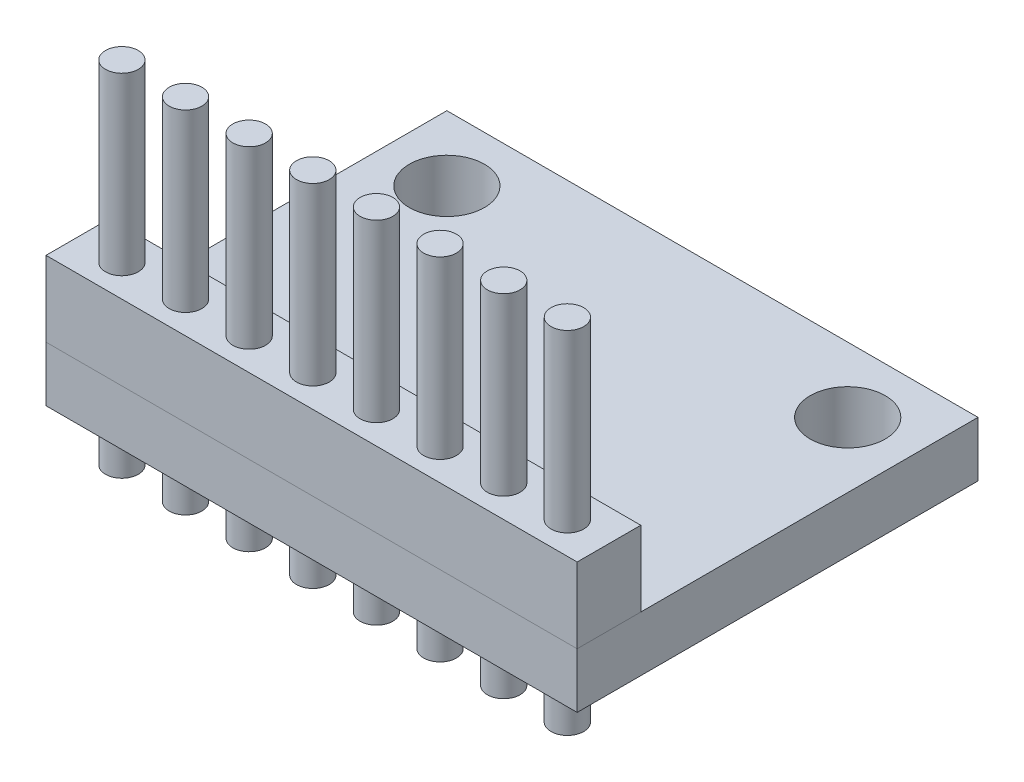
ISO-10303-21;
HEADER;
FILE_DESCRIPTION(('STEP AP214'),'2;1');
FILE_NAME('part.step','',(''),(''),'','','');
FILE_SCHEMA(('AUTOMOTIVE_DESIGN { 1 0 10303 214 1 1 1 1 }'));
ENDSEC;
DATA;
#1=APPLICATION_CONTEXT('core data for automotive mechanical design processes');
#2=APPLICATION_PROTOCOL_DEFINITION('international standard','automotive_design',2000,#1);
#3=PRODUCT_CONTEXT('',#1,'mechanical');
#4=PRODUCT('Part','Part','',(#3));
#5=PRODUCT_RELATED_PRODUCT_CATEGORY('part','',(#4));
#6=PRODUCT_DEFINITION_FORMATION('','',#4);
#7=PRODUCT_DEFINITION_CONTEXT('part definition',#1,'design');
#8=PRODUCT_DEFINITION('design','',#6,#7);
#9=PRODUCT_DEFINITION_SHAPE('','',#8);
#10=(LENGTH_UNIT() NAMED_UNIT(*) SI_UNIT(.MILLI.,.METRE.));
#11=(NAMED_UNIT(*) PLANE_ANGLE_UNIT() SI_UNIT($,.RADIAN.));
#12=(NAMED_UNIT(*) SI_UNIT($,.STERADIAN.) SOLID_ANGLE_UNIT());
#13=UNCERTAINTY_MEASURE_WITH_UNIT(LENGTH_MEASURE(1.E-05),#10,'distance_accuracy_value','');
#14=(GEOMETRIC_REPRESENTATION_CONTEXT(3) GLOBAL_UNCERTAINTY_ASSIGNED_CONTEXT((#13)) GLOBAL_UNIT_ASSIGNED_CONTEXT((#10,
#11,#12)) REPRESENTATION_CONTEXT('',''));
#15=CARTESIAN_POINT('',(0.,0.,0.));
#16=DIRECTION('',(0.,0.,1.));
#17=DIRECTION('',(1.,0.,0.));
#18=AXIS2_PLACEMENT_3D('',#15,#16,#17);
#19=CARTESIAN_POINT('',(-8.66705882352942,5.2,9.45294117647059));
#20=DIRECTION('',(1.,0.,0.));
#21=DIRECTION('',(0.,0.,-1.));
#22=AXIS2_PLACEMENT_3D('',#19,#20,#21);
#23=PLANE('',#22);
#24=DIRECTION('',(0.,0.,1.));
#25=VECTOR('',#24,1.);
#26=CARTESIAN_POINT('',(-8.66705882352942,2.2,9.45294117647059));
#27=LINE('',#26,#25);
#28=CARTESIAN_POINT('',(-8.66705882352942,2.2,6.91294117647059));
#29=VERTEX_POINT('',#28);
#30=CARTESIAN_POINT('',(-8.66705882352942,2.2,9.45294117647059));
#31=VERTEX_POINT('',#30);
#32=EDGE_CURVE('E105',#29,#31,#27,.T.);
#33=ORIENTED_EDGE('',*,*,#32,.T.);
#34=DIRECTION('',(0.,-1.,0.));
#35=VECTOR('',#34,1.);
#36=CARTESIAN_POINT('',(-8.66705882352942,5.2,9.45294117647059));
#37=LINE('',#36,#35);
#38=CARTESIAN_POINT('',(-8.66705882352942,5.2,9.45294117647059));
#39=VERTEX_POINT('',#38);
#40=EDGE_CURVE('E12',#39,#31,#37,.T.);
#41=ORIENTED_EDGE('',*,*,#40,.F.);
#42=DIRECTION('',(0.,0.,1.));
#43=VECTOR('',#42,1.);
#44=CARTESIAN_POINT('',(-8.66705882352942,5.2,9.45294117647059));
#45=LINE('',#44,#43);
#46=CARTESIAN_POINT('',(-8.66705882352942,5.2,6.91294117647059));
#47=VERTEX_POINT('',#46);
#48=EDGE_CURVE('E93',#47,#39,#45,.T.);
#49=ORIENTED_EDGE('',*,*,#48,.F.);
#50=DIRECTION('',(0.,-1.,0.));
#51=VECTOR('',#50,1.);
#52=CARTESIAN_POINT('',(-8.66705882352942,5.2,6.91294117647059));
#53=LINE('',#52,#51);
#54=EDGE_CURVE('E101',#47,#29,#53,.T.);
#55=ORIENTED_EDGE('',*,*,#54,.T.);
#56=EDGE_LOOP('',(#33,#41,#49,#55));
#57=FACE_BOUND('',#56,.T.);
#58=ADVANCED_FACE('F42',(#57),#23,.F.);
#59=CARTESIAN_POINT('',(-8.66705882352942,5.2,9.45294117647059));
#60=DIRECTION('',(0.,0.,-1.));
#61=DIRECTION('',(-1.,0.,0.));
#62=AXIS2_PLACEMENT_3D('',#59,#60,#61);
#63=PLANE('',#62);
#64=DIRECTION('',(1.,0.,0.));
#65=VECTOR('',#64,1.);
#66=CARTESIAN_POINT('',(-8.66705882352942,2.2,9.45294117647059));
#67=LINE('',#66,#65);
#68=CARTESIAN_POINT('',(12.5329411764706,2.2,9.45294117647059));
#69=VERTEX_POINT('',#68);
#70=EDGE_CURVE('E97',#31,#69,#67,.T.);
#71=ORIENTED_EDGE('',*,*,#70,.T.);
#72=DIRECTION('',(0.,-1.,0.));
#73=VECTOR('',#72,1.);
#74=CARTESIAN_POINT('',(12.5329411764706,5.2,9.45294117647059));
#75=LINE('',#74,#73);
#76=CARTESIAN_POINT('',(12.5329411764706,5.2,9.45294117647059));
#77=VERTEX_POINT('',#76);
#78=EDGE_CURVE('E50',#77,#69,#75,.T.);
#79=ORIENTED_EDGE('',*,*,#78,.F.);
#80=DIRECTION('',(1.,0.,0.));
#81=VECTOR('',#80,1.);
#82=CARTESIAN_POINT('',(-8.66705882352942,5.2,9.45294117647059));
#83=LINE('',#82,#81);
#84=EDGE_CURVE('E88',#39,#77,#83,.T.);
#85=ORIENTED_EDGE('',*,*,#84,.F.);
#86=ORIENTED_EDGE('',*,*,#40,.T.);
#87=EDGE_LOOP('',(#71,#79,#85,#86));
#88=FACE_BOUND('',#87,.T.);
#89=ADVANCED_FACE('F96',(#88),#63,.F.);
#90=CARTESIAN_POINT('',(12.5329411764706,5.2,9.45294117647059));
#91=DIRECTION('',(-1.,0.,0.));
#92=DIRECTION('',(0.,0.,1.));
#93=AXIS2_PLACEMENT_3D('',#90,#91,#92);
#94=PLANE('',#93);
#95=DIRECTION('',(0.,0.,-1.));
#96=VECTOR('',#95,1.);
#97=CARTESIAN_POINT('',(12.5329411764706,2.2,9.45294117647059));
#98=LINE('',#97,#96);
#99=CARTESIAN_POINT('',(12.5329411764706,2.2,6.91294117647059));
#100=VERTEX_POINT('',#99);
#101=EDGE_CURVE('E75',#69,#100,#98,.T.);
#102=ORIENTED_EDGE('',*,*,#101,.T.);
#103=DIRECTION('',(0.,-1.,0.));
#104=VECTOR('',#103,1.);
#105=CARTESIAN_POINT('',(12.5329411764706,5.2,6.91294117647059));
#106=LINE('',#105,#104);
#107=CARTESIAN_POINT('',(12.5329411764706,5.2,6.91294117647059));
#108=VERTEX_POINT('',#107);
#109=EDGE_CURVE('E98',#108,#100,#106,.T.);
#110=ORIENTED_EDGE('',*,*,#109,.F.);
#111=DIRECTION('',(0.,0.,-1.));
#112=VECTOR('',#111,1.);
#113=CARTESIAN_POINT('',(12.5329411764706,5.2,9.45294117647059));
#114=LINE('',#113,#112);
#115=EDGE_CURVE('E91',#77,#108,#114,.T.);
#116=ORIENTED_EDGE('',*,*,#115,.F.);
#117=ORIENTED_EDGE('',*,*,#78,.T.);
#118=EDGE_LOOP('',(#102,#110,#116,#117));
#119=FACE_BOUND('',#118,.T.);
#120=ADVANCED_FACE('F99',(#119),#94,.F.);
#121=CARTESIAN_POINT('',(-8.66705882352942,5.2,6.91294117647059));
#122=DIRECTION('',(0.,0.,1.));
#123=DIRECTION('',(1.,0.,0.));
#124=AXIS2_PLACEMENT_3D('',#121,#122,#123);
#125=PLANE('',#124);
#126=DIRECTION('',(-1.,0.,0.));
#127=VECTOR('',#126,1.);
#128=CARTESIAN_POINT('',(-8.66705882352942,2.2,6.91294117647059));
#129=LINE('',#128,#127);
#130=EDGE_CURVE('E81',#100,#29,#129,.T.);
#131=ORIENTED_EDGE('',*,*,#130,.T.);
#132=ORIENTED_EDGE('',*,*,#54,.F.);
#133=DIRECTION('',(-1.,0.,0.));
#134=VECTOR('',#133,1.);
#135=CARTESIAN_POINT('',(-8.66705882352942,5.2,6.91294117647059));
#136=LINE('',#135,#134);
#137=EDGE_CURVE('E58',#108,#47,#136,.T.);
#138=ORIENTED_EDGE('',*,*,#137,.F.);
#139=ORIENTED_EDGE('',*,*,#109,.T.);
#140=EDGE_LOOP('',(#131,#132,#138,#139));
#141=FACE_BOUND('',#140,.T.);
#142=ADVANCED_FACE('F112',(#141),#125,.F.);
#143=CARTESIAN_POINT('',(0.,5.2,0.));
#144=DIRECTION('',(0.,-1.,0.));
#145=DIRECTION('',(0.,0.,-1.));
#146=AXIS2_PLACEMENT_3D('',#143,#144,#145);
#147=PLANE('',#146);
#148=ORIENTED_EDGE('',*,*,#48,.T.);
#149=ORIENTED_EDGE('',*,*,#84,.T.);
#150=ORIENTED_EDGE('',*,*,#115,.T.);
#151=ORIENTED_EDGE('',*,*,#137,.T.);
#152=EDGE_LOOP('',(#148,#149,#150,#151));
#153=FACE_BOUND('',#152,.T.);
#154=ADVANCED_FACE('F89',(#153),#147,.F.);
#155=CARTESIAN_POINT('',(0.,2.2,0.));
#156=DIRECTION('',(0.,-1.,0.));
#157=DIRECTION('',(0.,0.,-1.));
#158=AXIS2_PLACEMENT_3D('',#155,#156,#157);
#159=PLANE('',#158);
#160=ORIENTED_EDGE('',*,*,#32,.F.);
#161=ORIENTED_EDGE('',*,*,#130,.F.);
#162=ORIENTED_EDGE('',*,*,#101,.F.);
#163=ORIENTED_EDGE('',*,*,#70,.F.);
#164=EDGE_LOOP('',(#160,#161,#162,#163));
#165=FACE_BOUND('',#164,.T.);
#166=ADVANCED_FACE('F115',(#165),#159,.T.);
#167=CLOSED_SHELL('',(#58,#89,#120,#142,#154,#166));
#168=MANIFOLD_SOLID_BREP('B2',#167);
#169=CARTESIAN_POINT('',(0.,0.,0.));
#170=DIRECTION('',(0.,1.,0.));
#171=DIRECTION('',(0.,0.,1.));
#172=AXIS2_PLACEMENT_3D('',#169,#170,#171);
#173=PLANE('',#172);
#174=DIRECTION('',(0.,0.,1.));
#175=VECTOR('',#174,1.);
#176=CARTESIAN_POINT('',(-8.66705882352942,0.,-6.54705882352941));
#177=LINE('',#176,#175);
#178=CARTESIAN_POINT('',(-8.66705882352942,0.,-6.54705882352941));
#179=VERTEX_POINT('',#178);
#180=CARTESIAN_POINT('',(-8.66705882352942,0.,9.45294117647059));
#181=VERTEX_POINT('',#180);
#182=EDGE_CURVE('E338',#179,#181,#177,.T.);
#183=ORIENTED_EDGE('',*,*,#182,.F.);
#184=DIRECTION('',(-1.,0.,0.));
#185=VECTOR('',#184,1.);
#186=CARTESIAN_POINT('',(-8.66705882352942,0.,-6.54705882352941));
#187=LINE('',#186,#185);
#188=CARTESIAN_POINT('',(12.5329411764706,0.,-6.54705882352941));
#189=VERTEX_POINT('',#188);
#190=EDGE_CURVE('E345',#189,#179,#187,.T.);
#191=ORIENTED_EDGE('',*,*,#190,.F.);
#192=DIRECTION('',(0.,0.,-1.));
#193=VECTOR('',#192,1.);
#194=CARTESIAN_POINT('',(12.5329411764706,0.,-6.54705882352941));
#195=LINE('',#194,#193);
#196=CARTESIAN_POINT('',(12.5329411764706,0.,9.45294117647059));
#197=VERTEX_POINT('',#196);
#198=EDGE_CURVE('E356',#197,#189,#195,.T.);
#199=ORIENTED_EDGE('',*,*,#198,.F.);
#200=DIRECTION('',(1.,0.,0.));
#201=VECTOR('',#200,1.);
#202=CARTESIAN_POINT('',(-8.66705882352942,0.,9.45294117647059));
#203=LINE('',#202,#201);
#204=EDGE_CURVE('E354',#181,#197,#203,.T.);
#205=ORIENTED_EDGE('',*,*,#204,.F.);
#206=EDGE_LOOP('',(#183,#191,#199,#205));
#207=FACE_BOUND('',#206,.T.);
#208=CARTESIAN_POINT('',(-6.06705882352942,0.,-3.94705882352941));
#209=DIRECTION('',(0.,1.,0.));
#210=DIRECTION('',(0.,0.,1.));
#211=AXIS2_PLACEMENT_3D('',#208,#209,#210);
#212=CIRCLE('',#211,1.5);
#213=CARTESIAN_POINT('',(-6.06705882352942,0.,-2.44705882352941));
#214=VERTEX_POINT('',#213);
#215=EDGE_CURVE('E335',#214,#214,#212,.T.);
#216=ORIENTED_EDGE('',*,*,#215,.T.);
#217=EDGE_LOOP('',(#216));
#218=FACE_BOUND('',#217,.T.);
#219=CARTESIAN_POINT('',(9.93294117647058,0.,-3.94705882352941));
#220=DIRECTION('',(0.,1.,0.));
#221=DIRECTION('',(0.,0.,1.));
#222=AXIS2_PLACEMENT_3D('',#219,#220,#221);
#223=CIRCLE('',#222,1.5);
#224=CARTESIAN_POINT('',(9.93294117647058,0.,-2.44705882352941));
#225=VERTEX_POINT('',#224);
#226=EDGE_CURVE('E329',#225,#225,#223,.T.);
#227=ORIENTED_EDGE('',*,*,#226,.T.);
#228=EDGE_LOOP('',(#227));
#229=FACE_BOUND('',#228,.T.);
#230=CARTESIAN_POINT('',(-6.90705882352942,0.,8.18294117647059));
#231=DIRECTION('',(0.,1.,0.));
#232=DIRECTION('',(0.,0.,1.));
#233=AXIS2_PLACEMENT_3D('',#230,#231,#232);
#234=CIRCLE('',#233,0.653464602854397);
#235=CARTESIAN_POINT('',(-6.90705882352942,0.,8.83640577932498));
#236=VERTEX_POINT('',#235);
#237=EDGE_CURVE('E370',#236,#236,#234,.F.);
#238=ORIENTED_EDGE('',*,*,#237,.F.);
#239=EDGE_LOOP('',(#238));
#240=FACE_BOUND('',#239,.T.);
#241=CARTESIAN_POINT('',(-4.36705882352942,0.,8.18294117647059));
#242=DIRECTION('',(0.,1.,0.));
#243=DIRECTION('',(0.,0.,1.));
#244=AXIS2_PLACEMENT_3D('',#241,#242,#243);
#245=CIRCLE('',#244,0.653464602854397);
#246=CARTESIAN_POINT('',(-4.36705882352942,0.,8.83640577932498));
#247=VERTEX_POINT('',#246);
#248=EDGE_CURVE('E373',#247,#247,#245,.F.);
#249=ORIENTED_EDGE('',*,*,#248,.F.);
#250=EDGE_LOOP('',(#249));
#251=FACE_BOUND('',#250,.T.);
#252=CARTESIAN_POINT('',(-1.82705882352942,0.,8.18294117647059));
#253=DIRECTION('',(0.,1.,0.));
#254=DIRECTION('',(0.,0.,1.));
#255=AXIS2_PLACEMENT_3D('',#252,#253,#254);
#256=CIRCLE('',#255,0.653464602854398);
#257=CARTESIAN_POINT('',(-1.82705882352942,0.,8.83640577932498));
#258=VERTEX_POINT('',#257);
#259=EDGE_CURVE('E376',#258,#258,#256,.F.);
#260=ORIENTED_EDGE('',*,*,#259,.F.);
#261=EDGE_LOOP('',(#260));
#262=FACE_BOUND('',#261,.T.);
#263=CARTESIAN_POINT('',(0.712941176470581,0.,8.18294117647059));
#264=DIRECTION('',(0.,1.,0.));
#265=DIRECTION('',(0.,0.,1.));
#266=AXIS2_PLACEMENT_3D('',#263,#264,#265);
#267=CIRCLE('',#266,0.653464602854398);
#268=CARTESIAN_POINT('',(0.712941176470581,0.,8.83640577932498));
#269=VERTEX_POINT('',#268);
#270=EDGE_CURVE('E379',#269,#269,#267,.F.);
#271=ORIENTED_EDGE('',*,*,#270,.F.);
#272=EDGE_LOOP('',(#271));
#273=FACE_BOUND('',#272,.T.);
#274=CARTESIAN_POINT('',(3.25294117647058,0.,8.18294117647059));
#275=DIRECTION('',(0.,1.,0.));
#276=DIRECTION('',(0.,0.,1.));
#277=AXIS2_PLACEMENT_3D('',#274,#275,#276);
#278=CIRCLE('',#277,0.653464602854398);
#279=CARTESIAN_POINT('',(3.25294117647058,0.,8.83640577932498));
#280=VERTEX_POINT('',#279);
#281=EDGE_CURVE('E382',#280,#280,#278,.F.);
#282=ORIENTED_EDGE('',*,*,#281,.F.);
#283=EDGE_LOOP('',(#282));
#284=FACE_BOUND('',#283,.T.);
#285=CARTESIAN_POINT('',(5.79294117647058,0.,8.18294117647059));
#286=DIRECTION('',(0.,1.,0.));
#287=DIRECTION('',(0.,0.,1.));
#288=AXIS2_PLACEMENT_3D('',#285,#286,#287);
#289=CIRCLE('',#288,0.653464602854403);
#290=CARTESIAN_POINT('',(5.79294117647058,0.,8.83640577932499));
#291=VERTEX_POINT('',#290);
#292=EDGE_CURVE('E385',#291,#291,#289,.F.);
#293=ORIENTED_EDGE('',*,*,#292,.F.);
#294=EDGE_LOOP('',(#293));
#295=FACE_BOUND('',#294,.T.);
#296=CARTESIAN_POINT('',(8.33294117647058,0.,8.18294117647059));
#297=DIRECTION('',(0.,1.,0.));
#298=DIRECTION('',(0.,0.,1.));
#299=AXIS2_PLACEMENT_3D('',#296,#297,#298);
#300=CIRCLE('',#299,0.653464602854399);
#301=CARTESIAN_POINT('',(8.33294117647058,0.,8.83640577932499));
#302=VERTEX_POINT('',#301);
#303=EDGE_CURVE('E173',#302,#302,#300,.F.);
#304=ORIENTED_EDGE('',*,*,#303,.F.);
#305=EDGE_LOOP('',(#304));
#306=FACE_BOUND('',#305,.T.);
#307=CARTESIAN_POINT('',(10.8729411764706,0.,8.18294117647059));
#308=DIRECTION('',(0.,1.,0.));
#309=DIRECTION('',(0.,0.,1.));
#310=AXIS2_PLACEMENT_3D('',#307,#308,#309);
#311=CIRCLE('',#310,0.653464602854399);
#312=CARTESIAN_POINT('',(10.8729411764706,0.,8.83640577932499));
#313=VERTEX_POINT('',#312);
#314=EDGE_CURVE('E40',#313,#313,#311,.F.);
#315=ORIENTED_EDGE('',*,*,#314,.F.);
#316=EDGE_LOOP('',(#315));
#317=FACE_BOUND('',#316,.T.);
#318=DIRECTION('',(0.,0.,1.));
#319=VECTOR('',#318,1.);
#320=CARTESIAN_POINT('',(3.67491142262111,0.,-0.351705240859701));
#321=LINE('',#320,#319);
#322=CARTESIAN_POINT('',(3.67491142262111,0.,-0.351705240859701));
#323=VERTEX_POINT('',#322);
#324=CARTESIAN_POINT('',(3.67491142262111,0.,3.66190750557394));
#325=VERTEX_POINT('',#324);
#326=EDGE_CURVE('E250',#323,#325,#321,.T.);
#327=ORIENTED_EDGE('',*,*,#326,.F.);
#328=DIRECTION('',(1.,0.,0.));
#329=VECTOR('',#328,1.);
#330=CARTESIAN_POINT('',(3.67491142262111,0.,-0.351705240859701));
#331=LINE('',#330,#329);
#332=CARTESIAN_POINT('',(-1.17882744650899,0.,-0.351705240859701));
#333=VERTEX_POINT('',#332);
#334=EDGE_CURVE('E247',#333,#323,#331,.T.);
#335=ORIENTED_EDGE('',*,*,#334,.F.);
#336=DIRECTION('',(0.,0.,-1.));
#337=VECTOR('',#336,1.);
#338=CARTESIAN_POINT('',(-1.17882744650899,0.,-0.351705240859701));
#339=LINE('',#338,#337);
#340=CARTESIAN_POINT('',(-1.17882744650899,0.,3.66190750557394));
#341=VERTEX_POINT('',#340);
#342=EDGE_CURVE('E185',#341,#333,#339,.T.);
#343=ORIENTED_EDGE('',*,*,#342,.F.);
#344=DIRECTION('',(-1.,0.,0.));
#345=VECTOR('',#344,1.);
#346=CARTESIAN_POINT('',(3.67491142262111,0.,3.66190750557394));
#347=LINE('',#346,#345);
#348=EDGE_CURVE('E180',#325,#341,#347,.T.);
#349=ORIENTED_EDGE('',*,*,#348,.F.);
#350=EDGE_LOOP('',(#327,#335,#343,#349));
#351=FACE_BOUND('',#350,.T.);
#352=ADVANCED_FACE('F165',(#207,#218,#229,#240,#251,#262,#273,#284,#295,#306,#317,#351),#173,.F.);
#353=CARTESIAN_POINT('',(-8.66705882352942,2.2,-6.54705882352941));
#354=DIRECTION('',(1.,0.,0.));
#355=DIRECTION('',(0.,0.,-1.));
#356=AXIS2_PLACEMENT_3D('',#353,#354,#355);
#357=PLANE('',#356);
#358=ORIENTED_EDGE('',*,*,#182,.T.);
#359=DIRECTION('',(0.,-1.,0.));
#360=VECTOR('',#359,1.);
#361=CARTESIAN_POINT('',(-8.66705882352942,2.2,9.45294117647059));
#362=LINE('',#361,#360);
#363=CARTESIAN_POINT('',(-8.66705882352942,2.2,9.45294117647059));
#364=VERTEX_POINT('',#363);
#365=EDGE_CURVE('E367',#364,#181,#362,.T.);
#366=ORIENTED_EDGE('',*,*,#365,.F.);
#367=DIRECTION('',(0.,0.,1.));
#368=VECTOR('',#367,1.);
#369=CARTESIAN_POINT('',(-8.66705882352942,2.2,-6.54705882352941));
#370=LINE('',#369,#368);
#371=CARTESIAN_POINT('',(-8.66705882352942,2.2,-6.54705882352941));
#372=VERTEX_POINT('',#371);
#373=EDGE_CURVE('E341',#372,#364,#370,.T.);
#374=ORIENTED_EDGE('',*,*,#373,.F.);
#375=DIRECTION('',(0.,-1.,0.));
#376=VECTOR('',#375,1.);
#377=CARTESIAN_POINT('',(-8.66705882352942,2.2,-6.54705882352941));
#378=LINE('',#377,#376);
#379=EDGE_CURVE('E351',#372,#179,#378,.T.);
#380=ORIENTED_EDGE('',*,*,#379,.T.);
#381=EDGE_LOOP('',(#358,#366,#374,#380));
#382=FACE_BOUND('',#381,.T.);
#383=ADVANCED_FACE('F167',(#382),#357,.F.);
#384=CARTESIAN_POINT('',(-8.66705882352942,2.2,9.45294117647059));
#385=DIRECTION('',(0.,0.,-1.));
#386=DIRECTION('',(-1.,0.,0.));
#387=AXIS2_PLACEMENT_3D('',#384,#385,#386);
#388=PLANE('',#387);
#389=ORIENTED_EDGE('',*,*,#204,.T.);
#390=DIRECTION('',(0.,-1.,0.));
#391=VECTOR('',#390,1.);
#392=CARTESIAN_POINT('',(12.5329411764706,2.2,9.45294117647059));
#393=LINE('',#392,#391);
#394=CARTESIAN_POINT('',(12.5329411764706,2.2,9.45294117647059));
#395=VERTEX_POINT('',#394);
#396=EDGE_CURVE('E364',#395,#197,#393,.T.);
#397=ORIENTED_EDGE('',*,*,#396,.F.);
#398=DIRECTION('',(1.,0.,0.));
#399=VECTOR('',#398,1.);
#400=CARTESIAN_POINT('',(-8.66705882352942,2.2,9.45294117647059));
#401=LINE('',#400,#399);
#402=EDGE_CURVE('E344',#364,#395,#401,.T.);
#403=ORIENTED_EDGE('',*,*,#402,.F.);
#404=ORIENTED_EDGE('',*,*,#365,.T.);
#405=EDGE_LOOP('',(#389,#397,#403,#404));
#406=FACE_BOUND('',#405,.T.);
#407=ADVANCED_FACE('F545',(#406),#388,.F.);
#408=CARTESIAN_POINT('',(12.5329411764706,2.2,-6.54705882352941));
#409=DIRECTION('',(-1.,0.,0.));
#410=DIRECTION('',(0.,0.,1.));
#411=AXIS2_PLACEMENT_3D('',#408,#409,#410);
#412=PLANE('',#411);
#413=ORIENTED_EDGE('',*,*,#198,.T.);
#414=DIRECTION('',(0.,-1.,0.));
#415=VECTOR('',#414,1.);
#416=CARTESIAN_POINT('',(12.5329411764706,2.2,-6.54705882352941));
#417=LINE('',#416,#415);
#418=CARTESIAN_POINT('',(12.5329411764706,2.2,-6.54705882352941));
#419=VERTEX_POINT('',#418);
#420=EDGE_CURVE('E361',#419,#189,#417,.T.);
#421=ORIENTED_EDGE('',*,*,#420,.F.);
#422=DIRECTION('',(0.,0.,-1.));
#423=VECTOR('',#422,1.);
#424=CARTESIAN_POINT('',(12.5329411764706,2.2,-6.54705882352941));
#425=LINE('',#424,#423);
#426=EDGE_CURVE('E347',#395,#419,#425,.T.);
#427=ORIENTED_EDGE('',*,*,#426,.F.);
#428=ORIENTED_EDGE('',*,*,#396,.T.);
#429=EDGE_LOOP('',(#413,#421,#427,#428));
#430=FACE_BOUND('',#429,.T.);
#431=ADVANCED_FACE('F542',(#430),#412,.F.);
#432=CARTESIAN_POINT('',(-8.66705882352942,2.2,-6.54705882352941));
#433=DIRECTION('',(0.,0.,1.));
#434=DIRECTION('',(1.,0.,0.));
#435=AXIS2_PLACEMENT_3D('',#432,#433,#434);
#436=PLANE('',#435);
#437=ORIENTED_EDGE('',*,*,#190,.T.);
#438=ORIENTED_EDGE('',*,*,#379,.F.);
#439=DIRECTION('',(-1.,0.,0.));
#440=VECTOR('',#439,1.);
#441=CARTESIAN_POINT('',(-8.66705882352942,2.2,-6.54705882352941));
#442=LINE('',#441,#440);
#443=EDGE_CURVE('E349',#419,#372,#442,.T.);
#444=ORIENTED_EDGE('',*,*,#443,.F.);
#445=ORIENTED_EDGE('',*,*,#420,.T.);
#446=EDGE_LOOP('',(#437,#438,#444,#445));
#447=FACE_BOUND('',#446,.T.);
#448=ADVANCED_FACE('F537',(#447),#436,.F.);
#449=CARTESIAN_POINT('',(0.,2.2,0.));
#450=DIRECTION('',(0.,1.,0.));
#451=DIRECTION('',(0.,0.,1.));
#452=AXIS2_PLACEMENT_3D('',#449,#450,#451);
#453=PLANE('',#452);
#454=CARTESIAN_POINT('',(10.8729411764706,2.2,8.18294117647059));
#455=DIRECTION('',(0.,1.,0.));
#456=DIRECTION('',(0.,0.,1.));
#457=AXIS2_PLACEMENT_3D('',#454,#455,#456);
#458=CIRCLE('',#457,0.653464602854399);
#459=CARTESIAN_POINT('',(10.8729411764706,2.2,8.83640577932499));
#460=VERTEX_POINT('',#459);
#461=EDGE_CURVE('E262',#460,#460,#458,.F.);
#462=ORIENTED_EDGE('',*,*,#461,.T.);
#463=EDGE_LOOP('',(#462));
#464=FACE_BOUND('',#463,.T.);
#465=CARTESIAN_POINT('',(8.33294117647058,2.2,8.18294117647059));
#466=DIRECTION('',(0.,1.,0.));
#467=DIRECTION('',(0.,0.,1.));
#468=AXIS2_PLACEMENT_3D('',#465,#466,#467);
#469=CIRCLE('',#468,0.653464602854399);
#470=CARTESIAN_POINT('',(8.33294117647058,2.2,8.83640577932499));
#471=VERTEX_POINT('',#470);
#472=EDGE_CURVE('E271',#471,#471,#469,.F.);
#473=ORIENTED_EDGE('',*,*,#472,.T.);
#474=EDGE_LOOP('',(#473));
#475=FACE_BOUND('',#474,.T.);
#476=CARTESIAN_POINT('',(5.79294117647058,2.2,8.18294117647059));
#477=DIRECTION('',(0.,1.,0.));
#478=DIRECTION('',(0.,0.,1.));
#479=AXIS2_PLACEMENT_3D('',#476,#477,#478);
#480=CIRCLE('',#479,0.653464602854403);
#481=CARTESIAN_POINT('',(5.79294117647058,2.2,8.83640577932499));
#482=VERTEX_POINT('',#481);
#483=EDGE_CURVE('E280',#482,#482,#480,.F.);
#484=ORIENTED_EDGE('',*,*,#483,.T.);
#485=EDGE_LOOP('',(#484));
#486=FACE_BOUND('',#485,.T.);
#487=CARTESIAN_POINT('',(3.25294117647058,2.2,8.18294117647059));
#488=DIRECTION('',(0.,1.,0.));
#489=DIRECTION('',(0.,0.,1.));
#490=AXIS2_PLACEMENT_3D('',#487,#488,#489);
#491=CIRCLE('',#490,0.653464602854398);
#492=CARTESIAN_POINT('',(3.25294117647058,2.2,8.83640577932498));
#493=VERTEX_POINT('',#492);
#494=EDGE_CURVE('E289',#493,#493,#491,.F.);
#495=ORIENTED_EDGE('',*,*,#494,.T.);
#496=EDGE_LOOP('',(#495));
#497=FACE_BOUND('',#496,.T.);
#498=CARTESIAN_POINT('',(0.712941176470581,2.2,8.18294117647059));
#499=DIRECTION('',(0.,1.,0.));
#500=DIRECTION('',(0.,0.,1.));
#501=AXIS2_PLACEMENT_3D('',#498,#499,#500);
#502=CIRCLE('',#501,0.653464602854398);
#503=CARTESIAN_POINT('',(0.712941176470581,2.2,8.83640577932498));
#504=VERTEX_POINT('',#503);
#505=EDGE_CURVE('E298',#504,#504,#502,.F.);
#506=ORIENTED_EDGE('',*,*,#505,.T.);
#507=EDGE_LOOP('',(#506));
#508=FACE_BOUND('',#507,.T.);
#509=CARTESIAN_POINT('',(-1.82705882352942,2.2,8.18294117647059));
#510=DIRECTION('',(0.,1.,0.));
#511=DIRECTION('',(0.,0.,1.));
#512=AXIS2_PLACEMENT_3D('',#509,#510,#511);
#513=CIRCLE('',#512,0.653464602854398);
#514=CARTESIAN_POINT('',(-1.82705882352942,2.2,8.83640577932498));
#515=VERTEX_POINT('',#514);
#516=EDGE_CURVE('E307',#515,#515,#513,.F.);
#517=ORIENTED_EDGE('',*,*,#516,.T.);
#518=EDGE_LOOP('',(#517));
#519=FACE_BOUND('',#518,.T.);
#520=CARTESIAN_POINT('',(-4.36705882352942,2.2,8.18294117647059));
#521=DIRECTION('',(0.,1.,0.));
#522=DIRECTION('',(0.,0.,1.));
#523=AXIS2_PLACEMENT_3D('',#520,#521,#522);
#524=CIRCLE('',#523,0.653464602854397);
#525=CARTESIAN_POINT('',(-4.36705882352942,2.2,8.83640577932498));
#526=VERTEX_POINT('',#525);
#527=EDGE_CURVE('E316',#526,#526,#524,.F.);
#528=ORIENTED_EDGE('',*,*,#527,.T.);
#529=EDGE_LOOP('',(#528));
#530=FACE_BOUND('',#529,.T.);
#531=CARTESIAN_POINT('',(-6.90705882352942,2.2,8.18294117647059));
#532=DIRECTION('',(0.,1.,0.));
#533=DIRECTION('',(0.,0.,1.));
#534=AXIS2_PLACEMENT_3D('',#531,#532,#533);
#535=CIRCLE('',#534,0.653464602854397);
#536=CARTESIAN_POINT('',(-6.90705882352942,2.2,8.83640577932498));
#537=VERTEX_POINT('',#536);
#538=EDGE_CURVE('E325',#537,#537,#535,.F.);
#539=ORIENTED_EDGE('',*,*,#538,.T.);
#540=EDGE_LOOP('',(#539));
#541=FACE_BOUND('',#540,.T.);
#542=CARTESIAN_POINT('',(9.93294117647058,2.2,-3.94705882352941));
#543=DIRECTION('',(0.,1.,0.));
#544=DIRECTION('',(0.,0.,1.));
#545=AXIS2_PLACEMENT_3D('',#542,#543,#544);
#546=CIRCLE('',#545,1.5);
#547=CARTESIAN_POINT('',(9.93294117647058,2.2,-2.44705882352941));
#548=VERTEX_POINT('',#547);
#549=EDGE_CURVE('E328',#548,#548,#546,.T.);
#550=ORIENTED_EDGE('',*,*,#549,.F.);
#551=EDGE_LOOP('',(#550));
#552=FACE_BOUND('',#551,.T.);
#553=CARTESIAN_POINT('',(-6.06705882352942,2.2,-3.94705882352941));
#554=DIRECTION('',(0.,1.,0.));
#555=DIRECTION('',(0.,0.,1.));
#556=AXIS2_PLACEMENT_3D('',#553,#554,#555);
#557=CIRCLE('',#556,1.5);
#558=CARTESIAN_POINT('',(-6.06705882352942,2.2,-2.44705882352941));
#559=VERTEX_POINT('',#558);
#560=EDGE_CURVE('E332',#559,#559,#557,.T.);
#561=ORIENTED_EDGE('',*,*,#560,.F.);
#562=EDGE_LOOP('',(#561));
#563=FACE_BOUND('',#562,.T.);
#564=ORIENTED_EDGE('',*,*,#373,.T.);
#565=ORIENTED_EDGE('',*,*,#402,.T.);
#566=ORIENTED_EDGE('',*,*,#426,.T.);
#567=ORIENTED_EDGE('',*,*,#443,.T.);
#568=EDGE_LOOP('',(#564,#565,#566,#567));
#569=FACE_BOUND('',#568,.T.);
#570=ADVANCED_FACE('F534',(#464,#475,#486,#497,#508,#519,#530,#541,#552,#563,#569),#453,.T.);
#571=CARTESIAN_POINT('',(-6.06705882352942,0.,-3.94705882352941));
#572=DIRECTION('',(0.,1.,0.));
#573=DIRECTION('',(0.,0.,1.));
#574=AXIS2_PLACEMENT_3D('',#571,#572,#573);
#575=CYLINDRICAL_SURFACE('',#574,1.5);
#576=ORIENTED_EDGE('',*,*,#215,.F.);
#577=EDGE_LOOP('',(#576));
#578=FACE_BOUND('',#577,.T.);
#579=ORIENTED_EDGE('',*,*,#560,.T.);
#580=EDGE_LOOP('',(#579));
#581=FACE_BOUND('',#580,.T.);
#582=ADVANCED_FACE('F530',(#578,#581),#575,.F.);
#583=CARTESIAN_POINT('',(9.93294117647058,0.,-3.94705882352941));
#584=DIRECTION('',(0.,1.,0.));
#585=DIRECTION('',(0.,0.,1.));
#586=AXIS2_PLACEMENT_3D('',#583,#584,#585);
#587=CYLINDRICAL_SURFACE('',#586,1.5);
#588=ORIENTED_EDGE('',*,*,#226,.F.);
#589=EDGE_LOOP('',(#588));
#590=FACE_BOUND('',#589,.T.);
#591=ORIENTED_EDGE('',*,*,#549,.T.);
#592=EDGE_LOOP('',(#591));
#593=FACE_BOUND('',#592,.T.);
#594=ADVANCED_FACE('F519',(#590,#593),#587,.F.);
#595=CARTESIAN_POINT('',(-6.90705882352942,-1.8,8.18294117647059));
#596=DIRECTION('',(0.,1.,0.));
#597=DIRECTION('',(0.,0.,1.));
#598=AXIS2_PLACEMENT_3D('',#595,#596,#597);
#599=PLANE('',#598);
#600=CARTESIAN_POINT('',(-6.90705882352942,-1.8,8.18294117647059));
#601=DIRECTION('',(0.,1.,0.));
#602=DIRECTION('',(0.,0.,1.));
#603=AXIS2_PLACEMENT_3D('',#600,#601,#602);
#604=CIRCLE('',#603,0.653464602854397);
#605=CARTESIAN_POINT('',(-6.90705882352942,-1.8,8.83640577932498));
#606=VERTEX_POINT('',#605);
#607=EDGE_CURVE('E319',#606,#606,#604,.T.);
#608=ORIENTED_EDGE('',*,*,#607,.F.);
#609=EDGE_LOOP('',(#608));
#610=FACE_BOUND('',#609,.T.);
#611=ADVANCED_FACE('F515',(#610),#599,.F.);
#612=CARTESIAN_POINT('',(-6.90705882352942,12.2,8.18294117647059));
#613=DIRECTION('',(0.,-1.,0.));
#614=DIRECTION('',(0.,0.,-1.));
#615=AXIS2_PLACEMENT_3D('',#612,#613,#614);
#616=CYLINDRICAL_SURFACE('',#615,0.653464602854397);
#617=ORIENTED_EDGE('',*,*,#607,.T.);
#618=EDGE_LOOP('',(#617));
#619=FACE_BOUND('',#618,.T.);
#620=ORIENTED_EDGE('',*,*,#237,.T.);
#621=EDGE_LOOP('',(#620));
#622=FACE_BOUND('',#621,.T.);
#623=ADVANCED_FACE('F518',(#619,#622),#616,.T.);
#624=ORIENTED_EDGE('',*,*,#538,.F.);
#625=EDGE_LOOP('',(#624));
#626=FACE_BOUND('',#625,.T.);
#627=CARTESIAN_POINT('',(-6.90705882352942,12.2,8.18294117647059));
#628=DIRECTION('',(0.,1.,0.));
#629=DIRECTION('',(0.,0.,1.));
#630=AXIS2_PLACEMENT_3D('',#627,#628,#629);
#631=CIRCLE('',#630,0.653464602854397);
#632=CARTESIAN_POINT('',(-6.90705882352942,12.2,8.83640577932498));
#633=VERTEX_POINT('',#632);
#634=EDGE_CURVE('E322',#633,#633,#631,.T.);
#635=ORIENTED_EDGE('',*,*,#634,.F.);
#636=EDGE_LOOP('',(#635));
#637=FACE_BOUND('',#636,.T.);
#638=ADVANCED_FACE('F523',(#626,#637),#616,.T.);
#639=CARTESIAN_POINT('',(-6.90705882352942,12.2,8.18294117647059));
#640=DIRECTION('',(0.,1.,0.));
#641=DIRECTION('',(0.,0.,1.));
#642=AXIS2_PLACEMENT_3D('',#639,#640,#641);
#643=PLANE('',#642);
#644=ORIENTED_EDGE('',*,*,#634,.T.);
#645=EDGE_LOOP('',(#644));
#646=FACE_BOUND('',#645,.T.);
#647=ADVANCED_FACE('F506',(#646),#643,.T.);
#648=CARTESIAN_POINT('',(-4.36705882352942,-1.8,8.18294117647059));
#649=DIRECTION('',(0.,1.,0.));
#650=DIRECTION('',(0.,0.,1.));
#651=AXIS2_PLACEMENT_3D('',#648,#649,#650);
#652=PLANE('',#651);
#653=CARTESIAN_POINT('',(-4.36705882352942,-1.8,8.18294117647059));
#654=DIRECTION('',(0.,1.,0.));
#655=DIRECTION('',(0.,0.,1.));
#656=AXIS2_PLACEMENT_3D('',#653,#654,#655);
#657=CIRCLE('',#656,0.653464602854397);
#658=CARTESIAN_POINT('',(-4.36705882352942,-1.8,8.83640577932498));
#659=VERTEX_POINT('',#658);
#660=EDGE_CURVE('E310',#659,#659,#657,.T.);
#661=ORIENTED_EDGE('',*,*,#660,.F.);
#662=EDGE_LOOP('',(#661));
#663=FACE_BOUND('',#662,.T.);
#664=ADVANCED_FACE('F502',(#663),#652,.F.);
#665=CARTESIAN_POINT('',(-4.36705882352942,12.2,8.18294117647059));
#666=DIRECTION('',(0.,-1.,0.));
#667=DIRECTION('',(0.,0.,-1.));
#668=AXIS2_PLACEMENT_3D('',#665,#666,#667);
#669=CYLINDRICAL_SURFACE('',#668,0.653464602854397);
#670=ORIENTED_EDGE('',*,*,#660,.T.);
#671=EDGE_LOOP('',(#670));
#672=FACE_BOUND('',#671,.T.);
#673=ORIENTED_EDGE('',*,*,#248,.T.);
#674=EDGE_LOOP('',(#673));
#675=FACE_BOUND('',#674,.T.);
#676=ADVANCED_FACE('F505',(#672,#675),#669,.T.);
#677=ORIENTED_EDGE('',*,*,#527,.F.);
#678=EDGE_LOOP('',(#677));
#679=FACE_BOUND('',#678,.T.);
#680=CARTESIAN_POINT('',(-4.36705882352942,12.2,8.18294117647059));
#681=DIRECTION('',(0.,1.,0.));
#682=DIRECTION('',(0.,0.,1.));
#683=AXIS2_PLACEMENT_3D('',#680,#681,#682);
#684=CIRCLE('',#683,0.653464602854397);
#685=CARTESIAN_POINT('',(-4.36705882352942,12.2,8.83640577932498));
#686=VERTEX_POINT('',#685);
#687=EDGE_CURVE('E313',#686,#686,#684,.T.);
#688=ORIENTED_EDGE('',*,*,#687,.F.);
#689=EDGE_LOOP('',(#688));
#690=FACE_BOUND('',#689,.T.);
#691=ADVANCED_FACE('F510',(#679,#690),#669,.T.);
#692=CARTESIAN_POINT('',(-4.36705882352942,12.2,8.18294117647059));
#693=DIRECTION('',(0.,1.,0.));
#694=DIRECTION('',(0.,0.,1.));
#695=AXIS2_PLACEMENT_3D('',#692,#693,#694);
#696=PLANE('',#695);
#697=ORIENTED_EDGE('',*,*,#687,.T.);
#698=EDGE_LOOP('',(#697));
#699=FACE_BOUND('',#698,.T.);
#700=ADVANCED_FACE('F493',(#699),#696,.T.);
#701=CARTESIAN_POINT('',(-1.82705882352942,-1.8,8.18294117647059));
#702=DIRECTION('',(0.,1.,0.));
#703=DIRECTION('',(0.,0.,1.));
#704=AXIS2_PLACEMENT_3D('',#701,#702,#703);
#705=PLANE('',#704);
#706=CARTESIAN_POINT('',(-1.82705882352942,-1.8,8.18294117647059));
#707=DIRECTION('',(0.,1.,0.));
#708=DIRECTION('',(0.,0.,1.));
#709=AXIS2_PLACEMENT_3D('',#706,#707,#708);
#710=CIRCLE('',#709,0.653464602854398);
#711=CARTESIAN_POINT('',(-1.82705882352942,-1.8,8.83640577932498));
#712=VERTEX_POINT('',#711);
#713=EDGE_CURVE('E301',#712,#712,#710,.T.);
#714=ORIENTED_EDGE('',*,*,#713,.F.);
#715=EDGE_LOOP('',(#714));
#716=FACE_BOUND('',#715,.T.);
#717=ADVANCED_FACE('F489',(#716),#705,.F.);
#718=CARTESIAN_POINT('',(-1.82705882352942,12.2,8.18294117647059));
#719=DIRECTION('',(0.,-1.,0.));
#720=DIRECTION('',(0.,0.,-1.));
#721=AXIS2_PLACEMENT_3D('',#718,#719,#720);
#722=CYLINDRICAL_SURFACE('',#721,0.653464602854398);
#723=ORIENTED_EDGE('',*,*,#713,.T.);
#724=EDGE_LOOP('',(#723));
#725=FACE_BOUND('',#724,.T.);
#726=ORIENTED_EDGE('',*,*,#259,.T.);
#727=EDGE_LOOP('',(#726));
#728=FACE_BOUND('',#727,.T.);
#729=ADVANCED_FACE('F492',(#725,#728),#722,.T.);
#730=ORIENTED_EDGE('',*,*,#516,.F.);
#731=EDGE_LOOP('',(#730));
#732=FACE_BOUND('',#731,.T.);
#733=CARTESIAN_POINT('',(-1.82705882352942,12.2,8.18294117647059));
#734=DIRECTION('',(0.,1.,0.));
#735=DIRECTION('',(0.,0.,1.));
#736=AXIS2_PLACEMENT_3D('',#733,#734,#735);
#737=CIRCLE('',#736,0.653464602854398);
#738=CARTESIAN_POINT('',(-1.82705882352942,12.2,8.83640577932498));
#739=VERTEX_POINT('',#738);
#740=EDGE_CURVE('E304',#739,#739,#737,.T.);
#741=ORIENTED_EDGE('',*,*,#740,.F.);
#742=EDGE_LOOP('',(#741));
#743=FACE_BOUND('',#742,.T.);
#744=ADVANCED_FACE('F497',(#732,#743),#722,.T.);
#745=CARTESIAN_POINT('',(-1.82705882352942,12.2,8.18294117647059));
#746=DIRECTION('',(0.,1.,0.));
#747=DIRECTION('',(0.,0.,1.));
#748=AXIS2_PLACEMENT_3D('',#745,#746,#747);
#749=PLANE('',#748);
#750=ORIENTED_EDGE('',*,*,#740,.T.);
#751=EDGE_LOOP('',(#750));
#752=FACE_BOUND('',#751,.T.);
#753=ADVANCED_FACE('F480',(#752),#749,.T.);
#754=CARTESIAN_POINT('',(0.712941176470581,-1.8,8.18294117647059));
#755=DIRECTION('',(0.,1.,0.));
#756=DIRECTION('',(0.,0.,1.));
#757=AXIS2_PLACEMENT_3D('',#754,#755,#756);
#758=PLANE('',#757);
#759=CARTESIAN_POINT('',(0.712941176470581,-1.8,8.18294117647059));
#760=DIRECTION('',(0.,1.,0.));
#761=DIRECTION('',(0.,0.,1.));
#762=AXIS2_PLACEMENT_3D('',#759,#760,#761);
#763=CIRCLE('',#762,0.653464602854398);
#764=CARTESIAN_POINT('',(0.712941176470581,-1.8,8.83640577932498));
#765=VERTEX_POINT('',#764);
#766=EDGE_CURVE('E292',#765,#765,#763,.T.);
#767=ORIENTED_EDGE('',*,*,#766,.F.);
#768=EDGE_LOOP('',(#767));
#769=FACE_BOUND('',#768,.T.);
#770=ADVANCED_FACE('F476',(#769),#758,.F.);
#771=CARTESIAN_POINT('',(0.712941176470581,12.2,8.18294117647059));
#772=DIRECTION('',(0.,-1.,0.));
#773=DIRECTION('',(0.,0.,-1.));
#774=AXIS2_PLACEMENT_3D('',#771,#772,#773);
#775=CYLINDRICAL_SURFACE('',#774,0.653464602854398);
#776=ORIENTED_EDGE('',*,*,#766,.T.);
#777=EDGE_LOOP('',(#776));
#778=FACE_BOUND('',#777,.T.);
#779=ORIENTED_EDGE('',*,*,#270,.T.);
#780=EDGE_LOOP('',(#779));
#781=FACE_BOUND('',#780,.T.);
#782=ADVANCED_FACE('F479',(#778,#781),#775,.T.);
#783=ORIENTED_EDGE('',*,*,#505,.F.);
#784=EDGE_LOOP('',(#783));
#785=FACE_BOUND('',#784,.T.);
#786=CARTESIAN_POINT('',(0.712941176470581,12.2,8.18294117647059));
#787=DIRECTION('',(0.,1.,0.));
#788=DIRECTION('',(0.,0.,1.));
#789=AXIS2_PLACEMENT_3D('',#786,#787,#788);
#790=CIRCLE('',#789,0.653464602854398);
#791=CARTESIAN_POINT('',(0.712941176470581,12.2,8.83640577932498));
#792=VERTEX_POINT('',#791);
#793=EDGE_CURVE('E295',#792,#792,#790,.T.);
#794=ORIENTED_EDGE('',*,*,#793,.F.);
#795=EDGE_LOOP('',(#794));
#796=FACE_BOUND('',#795,.T.);
#797=ADVANCED_FACE('F484',(#785,#796),#775,.T.);
#798=CARTESIAN_POINT('',(0.712941176470581,12.2,8.18294117647059));
#799=DIRECTION('',(0.,1.,0.));
#800=DIRECTION('',(0.,0.,1.));
#801=AXIS2_PLACEMENT_3D('',#798,#799,#800);
#802=PLANE('',#801);
#803=ORIENTED_EDGE('',*,*,#793,.T.);
#804=EDGE_LOOP('',(#803));
#805=FACE_BOUND('',#804,.T.);
#806=ADVANCED_FACE('F467',(#805),#802,.T.);
#807=CARTESIAN_POINT('',(3.25294117647058,-1.8,8.18294117647059));
#808=DIRECTION('',(0.,1.,0.));
#809=DIRECTION('',(0.,0.,1.));
#810=AXIS2_PLACEMENT_3D('',#807,#808,#809);
#811=PLANE('',#810);
#812=CARTESIAN_POINT('',(3.25294117647058,-1.8,8.18294117647059));
#813=DIRECTION('',(0.,1.,0.));
#814=DIRECTION('',(0.,0.,1.));
#815=AXIS2_PLACEMENT_3D('',#812,#813,#814);
#816=CIRCLE('',#815,0.653464602854398);
#817=CARTESIAN_POINT('',(3.25294117647058,-1.8,8.83640577932498));
#818=VERTEX_POINT('',#817);
#819=EDGE_CURVE('E283',#818,#818,#816,.T.);
#820=ORIENTED_EDGE('',*,*,#819,.F.);
#821=EDGE_LOOP('',(#820));
#822=FACE_BOUND('',#821,.T.);
#823=ADVANCED_FACE('F463',(#822),#811,.F.);
#824=CARTESIAN_POINT('',(3.25294117647058,12.2,8.18294117647059));
#825=DIRECTION('',(0.,-1.,0.));
#826=DIRECTION('',(0.,0.,-1.));
#827=AXIS2_PLACEMENT_3D('',#824,#825,#826);
#828=CYLINDRICAL_SURFACE('',#827,0.653464602854398);
#829=ORIENTED_EDGE('',*,*,#819,.T.);
#830=EDGE_LOOP('',(#829));
#831=FACE_BOUND('',#830,.T.);
#832=ORIENTED_EDGE('',*,*,#281,.T.);
#833=EDGE_LOOP('',(#832));
#834=FACE_BOUND('',#833,.T.);
#835=ADVANCED_FACE('F466',(#831,#834),#828,.T.);
#836=ORIENTED_EDGE('',*,*,#494,.F.);
#837=EDGE_LOOP('',(#836));
#838=FACE_BOUND('',#837,.T.);
#839=CARTESIAN_POINT('',(3.25294117647058,12.2,8.18294117647059));
#840=DIRECTION('',(0.,1.,0.));
#841=DIRECTION('',(0.,0.,1.));
#842=AXIS2_PLACEMENT_3D('',#839,#840,#841);
#843=CIRCLE('',#842,0.653464602854398);
#844=CARTESIAN_POINT('',(3.25294117647058,12.2,8.83640577932498));
#845=VERTEX_POINT('',#844);
#846=EDGE_CURVE('E286',#845,#845,#843,.T.);
#847=ORIENTED_EDGE('',*,*,#846,.F.);
#848=EDGE_LOOP('',(#847));
#849=FACE_BOUND('',#848,.T.);
#850=ADVANCED_FACE('F471',(#838,#849),#828,.T.);
#851=CARTESIAN_POINT('',(3.25294117647058,12.2,8.18294117647059));
#852=DIRECTION('',(0.,1.,0.));
#853=DIRECTION('',(0.,0.,1.));
#854=AXIS2_PLACEMENT_3D('',#851,#852,#853);
#855=PLANE('',#854);
#856=ORIENTED_EDGE('',*,*,#846,.T.);
#857=EDGE_LOOP('',(#856));
#858=FACE_BOUND('',#857,.T.);
#859=ADVANCED_FACE('F454',(#858),#855,.T.);
#860=CARTESIAN_POINT('',(5.79294117647058,-1.8,8.18294117647059));
#861=DIRECTION('',(0.,1.,0.));
#862=DIRECTION('',(0.,0.,1.));
#863=AXIS2_PLACEMENT_3D('',#860,#861,#862);
#864=PLANE('',#863);
#865=CARTESIAN_POINT('',(5.79294117647058,-1.8,8.18294117647059));
#866=DIRECTION('',(0.,1.,0.));
#867=DIRECTION('',(0.,0.,1.));
#868=AXIS2_PLACEMENT_3D('',#865,#866,#867);
#869=CIRCLE('',#868,0.653464602854403);
#870=CARTESIAN_POINT('',(5.79294117647058,-1.8,8.83640577932499));
#871=VERTEX_POINT('',#870);
#872=EDGE_CURVE('E274',#871,#871,#869,.T.);
#873=ORIENTED_EDGE('',*,*,#872,.F.);
#874=EDGE_LOOP('',(#873));
#875=FACE_BOUND('',#874,.T.);
#876=ADVANCED_FACE('F450',(#875),#864,.F.);
#877=CARTESIAN_POINT('',(5.79294117647058,12.2,8.18294117647059));
#878=DIRECTION('',(0.,-1.,0.));
#879=DIRECTION('',(0.,0.,-1.));
#880=AXIS2_PLACEMENT_3D('',#877,#878,#879);
#881=CYLINDRICAL_SURFACE('',#880,0.653464602854403);
#882=ORIENTED_EDGE('',*,*,#872,.T.);
#883=EDGE_LOOP('',(#882));
#884=FACE_BOUND('',#883,.T.);
#885=ORIENTED_EDGE('',*,*,#292,.T.);
#886=EDGE_LOOP('',(#885));
#887=FACE_BOUND('',#886,.T.);
#888=ADVANCED_FACE('F453',(#884,#887),#881,.T.);
#889=ORIENTED_EDGE('',*,*,#483,.F.);
#890=EDGE_LOOP('',(#889));
#891=FACE_BOUND('',#890,.T.);
#892=CARTESIAN_POINT('',(5.79294117647058,12.2,8.18294117647059));
#893=DIRECTION('',(0.,1.,0.));
#894=DIRECTION('',(0.,0.,1.));
#895=AXIS2_PLACEMENT_3D('',#892,#893,#894);
#896=CIRCLE('',#895,0.653464602854403);
#897=CARTESIAN_POINT('',(5.79294117647058,12.2,8.83640577932499));
#898=VERTEX_POINT('',#897);
#899=EDGE_CURVE('E277',#898,#898,#896,.T.);
#900=ORIENTED_EDGE('',*,*,#899,.F.);
#901=EDGE_LOOP('',(#900));
#902=FACE_BOUND('',#901,.T.);
#903=ADVANCED_FACE('F458',(#891,#902),#881,.T.);
#904=CARTESIAN_POINT('',(5.79294117647058,12.2,8.18294117647059));
#905=DIRECTION('',(0.,1.,0.));
#906=DIRECTION('',(0.,0.,1.));
#907=AXIS2_PLACEMENT_3D('',#904,#905,#906);
#908=PLANE('',#907);
#909=ORIENTED_EDGE('',*,*,#899,.T.);
#910=EDGE_LOOP('',(#909));
#911=FACE_BOUND('',#910,.T.);
#912=ADVANCED_FACE('F441',(#911),#908,.T.);
#913=CARTESIAN_POINT('',(8.33294117647058,-1.8,8.18294117647059));
#914=DIRECTION('',(0.,1.,0.));
#915=DIRECTION('',(0.,0.,1.));
#916=AXIS2_PLACEMENT_3D('',#913,#914,#915);
#917=PLANE('',#916);
#918=CARTESIAN_POINT('',(8.33294117647058,-1.8,8.18294117647059));
#919=DIRECTION('',(0.,1.,0.));
#920=DIRECTION('',(0.,0.,1.));
#921=AXIS2_PLACEMENT_3D('',#918,#919,#920);
#922=CIRCLE('',#921,0.653464602854399);
#923=CARTESIAN_POINT('',(8.33294117647058,-1.8,8.83640577932499));
#924=VERTEX_POINT('',#923);
#925=EDGE_CURVE('E265',#924,#924,#922,.T.);
#926=ORIENTED_EDGE('',*,*,#925,.F.);
#927=EDGE_LOOP('',(#926));
#928=FACE_BOUND('',#927,.T.);
#929=ADVANCED_FACE('F438',(#928),#917,.F.);
#930=CARTESIAN_POINT('',(8.33294117647058,12.2,8.18294117647059));
#931=DIRECTION('',(0.,-1.,0.));
#932=DIRECTION('',(0.,0.,-1.));
#933=AXIS2_PLACEMENT_3D('',#930,#931,#932);
#934=CYLINDRICAL_SURFACE('',#933,0.653464602854399);
#935=ORIENTED_EDGE('',*,*,#925,.T.);
#936=EDGE_LOOP('',(#935));
#937=FACE_BOUND('',#936,.T.);
#938=ORIENTED_EDGE('',*,*,#303,.T.);
#939=EDGE_LOOP('',(#938));
#940=FACE_BOUND('',#939,.T.);
#941=ADVANCED_FACE('F390',(#937,#940),#934,.T.);
#942=ORIENTED_EDGE('',*,*,#472,.F.);
#943=EDGE_LOOP('',(#942));
#944=FACE_BOUND('',#943,.T.);
#945=CARTESIAN_POINT('',(8.33294117647058,12.2,8.18294117647059));
#946=DIRECTION('',(0.,1.,0.));
#947=DIRECTION('',(0.,0.,1.));
#948=AXIS2_PLACEMENT_3D('',#945,#946,#947);
#949=CIRCLE('',#948,0.653464602854399);
#950=CARTESIAN_POINT('',(8.33294117647058,12.2,8.83640577932499));
#951=VERTEX_POINT('',#950);
#952=EDGE_CURVE('E268',#951,#951,#949,.T.);
#953=ORIENTED_EDGE('',*,*,#952,.F.);
#954=EDGE_LOOP('',(#953));
#955=FACE_BOUND('',#954,.T.);
#956=ADVANCED_FACE('F445',(#944,#955),#934,.T.);
#957=CARTESIAN_POINT('',(8.33294117647058,12.2,8.18294117647059));
#958=DIRECTION('',(0.,1.,0.));
#959=DIRECTION('',(0.,0.,1.));
#960=AXIS2_PLACEMENT_3D('',#957,#958,#959);
#961=PLANE('',#960);
#962=ORIENTED_EDGE('',*,*,#952,.T.);
#963=EDGE_LOOP('',(#962));
#964=FACE_BOUND('',#963,.T.);
#965=ADVANCED_FACE('F429',(#964),#961,.T.);
#966=CARTESIAN_POINT('',(10.8729411764706,-1.8,8.18294117647059));
#967=DIRECTION('',(0.,1.,0.));
#968=DIRECTION('',(0.,0.,1.));
#969=AXIS2_PLACEMENT_3D('',#966,#967,#968);
#970=PLANE('',#969);
#971=CARTESIAN_POINT('',(10.8729411764706,-1.8,8.18294117647059));
#972=DIRECTION('',(0.,1.,0.));
#973=DIRECTION('',(0.,0.,1.));
#974=AXIS2_PLACEMENT_3D('',#971,#972,#973);
#975=CIRCLE('',#974,0.653464602854399);
#976=CARTESIAN_POINT('',(10.8729411764706,-1.8,8.83640577932499));
#977=VERTEX_POINT('',#976);
#978=EDGE_CURVE('E251',#977,#977,#975,.T.);
#979=ORIENTED_EDGE('',*,*,#978,.F.);
#980=EDGE_LOOP('',(#979));
#981=FACE_BOUND('',#980,.T.);
#982=ADVANCED_FACE('F425',(#981),#970,.F.);
#983=CARTESIAN_POINT('',(10.8729411764706,12.2,8.18294117647059));
#984=DIRECTION('',(0.,-1.,0.));
#985=DIRECTION('',(0.,0.,-1.));
#986=AXIS2_PLACEMENT_3D('',#983,#984,#985);
#987=CYLINDRICAL_SURFACE('',#986,0.653464602854399);
#988=ORIENTED_EDGE('',*,*,#978,.T.);
#989=EDGE_LOOP('',(#988));
#990=FACE_BOUND('',#989,.T.);
#991=ORIENTED_EDGE('',*,*,#314,.T.);
#992=EDGE_LOOP('',(#991));
#993=FACE_BOUND('',#992,.T.);
#994=ADVANCED_FACE('F428',(#990,#993),#987,.T.);
#995=ORIENTED_EDGE('',*,*,#461,.F.);
#996=EDGE_LOOP('',(#995));
#997=FACE_BOUND('',#996,.T.);
#998=CARTESIAN_POINT('',(10.8729411764706,12.2,8.18294117647059));
#999=DIRECTION('',(0.,1.,0.));
#1000=DIRECTION('',(0.,0.,1.));
#1001=AXIS2_PLACEMENT_3D('',#998,#999,#1000);
#1002=CIRCLE('',#1001,0.653464602854399);
#1003=CARTESIAN_POINT('',(10.8729411764706,12.2,8.83640577932499));
#1004=VERTEX_POINT('',#1003);
#1005=EDGE_CURVE('E254',#1004,#1004,#1002,.T.);
#1006=ORIENTED_EDGE('',*,*,#1005,.F.);
#1007=EDGE_LOOP('',(#1006));
#1008=FACE_BOUND('',#1007,.T.);
#1009=ADVANCED_FACE('F433',(#997,#1008),#987,.T.);
#1010=CARTESIAN_POINT('',(10.8729411764706,12.2,8.18294117647059));
#1011=DIRECTION('',(0.,1.,0.));
#1012=DIRECTION('',(0.,0.,1.));
#1013=AXIS2_PLACEMENT_3D('',#1010,#1011,#1012);
#1014=PLANE('',#1013);
#1015=ORIENTED_EDGE('',*,*,#1005,.T.);
#1016=EDGE_LOOP('',(#1015));
#1017=FACE_BOUND('',#1016,.T.);
#1018=ADVANCED_FACE('F424',(#1017),#1014,.T.);
#1019=CARTESIAN_POINT('',(3.67491142262111,-1.,-0.351705240859701));
#1020=DIRECTION('',(-1.,0.,0.));
#1021=DIRECTION('',(0.,0.,1.));
#1022=AXIS2_PLACEMENT_3D('',#1019,#1020,#1021);
#1023=PLANE('',#1022);
#1024=ORIENTED_EDGE('',*,*,#326,.T.);
#1025=DIRECTION('',(0.,1.,0.));
#1026=VECTOR('',#1025,1.);
#1027=CARTESIAN_POINT('',(3.67491142262111,-1.,3.66190750557394));
#1028=LINE('',#1027,#1026);
#1029=CARTESIAN_POINT('',(3.67491142262111,-1.,3.66190750557394));
#1030=VERTEX_POINT('',#1029);
#1031=EDGE_CURVE('E231',#1030,#325,#1028,.T.);
#1032=ORIENTED_EDGE('',*,*,#1031,.F.);
#1033=DIRECTION('',(0.,0.,1.));
#1034=VECTOR('',#1033,1.);
#1035=CARTESIAN_POINT('',(3.67491142262111,-1.,-0.351705240859701));
#1036=LINE('',#1035,#1034);
#1037=CARTESIAN_POINT('',(3.67491142262111,-1.,-0.351705240859701));
#1038=VERTEX_POINT('',#1037);
#1039=EDGE_CURVE('E238',#1038,#1030,#1036,.T.);
#1040=ORIENTED_EDGE('',*,*,#1039,.F.);
#1041=DIRECTION('',(0.,1.,0.));
#1042=VECTOR('',#1041,1.);
#1043=CARTESIAN_POINT('',(3.67491142262111,-1.,-0.351705240859701));
#1044=LINE('',#1043,#1042);
#1045=EDGE_CURVE('E402',#1038,#323,#1044,.T.);
#1046=ORIENTED_EDGE('',*,*,#1045,.T.);
#1047=EDGE_LOOP('',(#1024,#1032,#1040,#1046));
#1048=FACE_BOUND('',#1047,.T.);
#1049=ADVANCED_FACE('F249',(#1048),#1023,.F.);
#1050=CARTESIAN_POINT('',(3.67491142262111,-1.,3.66190750557394));
#1051=DIRECTION('',(0.,0.,-1.));
#1052=DIRECTION('',(-1.,0.,0.));
#1053=AXIS2_PLACEMENT_3D('',#1050,#1051,#1052);
#1054=PLANE('',#1053);
#1055=ORIENTED_EDGE('',*,*,#348,.T.);
#1056=DIRECTION('',(0.,1.,0.));
#1057=VECTOR('',#1056,1.);
#1058=CARTESIAN_POINT('',(-1.17882744650899,-1.,3.66190750557394));
#1059=LINE('',#1058,#1057);
#1060=CARTESIAN_POINT('',(-1.17882744650899,-1.,3.66190750557394));
#1061=VERTEX_POINT('',#1060);
#1062=EDGE_CURVE('E234',#1061,#341,#1059,.T.);
#1063=ORIENTED_EDGE('',*,*,#1062,.F.);
#1064=DIRECTION('',(-1.,0.,0.));
#1065=VECTOR('',#1064,1.);
#1066=CARTESIAN_POINT('',(3.67491142262111,-1.,3.66190750557394));
#1067=LINE('',#1066,#1065);
#1068=EDGE_CURVE('E227',#1030,#1061,#1067,.T.);
#1069=ORIENTED_EDGE('',*,*,#1068,.F.);
#1070=ORIENTED_EDGE('',*,*,#1031,.T.);
#1071=EDGE_LOOP('',(#1055,#1063,#1069,#1070));
#1072=FACE_BOUND('',#1071,.T.);
#1073=ADVANCED_FACE('F229',(#1072),#1054,.F.);
#1074=CARTESIAN_POINT('',(-1.17882744650899,-1.,-0.351705240859701));
#1075=DIRECTION('',(1.,0.,0.));
#1076=DIRECTION('',(0.,0.,-1.));
#1077=AXIS2_PLACEMENT_3D('',#1074,#1075,#1076);
#1078=PLANE('',#1077);
#1079=ORIENTED_EDGE('',*,*,#342,.T.);
#1080=DIRECTION('',(0.,1.,0.));
#1081=VECTOR('',#1080,1.);
#1082=CARTESIAN_POINT('',(-1.17882744650899,-1.,-0.351705240859701));
#1083=LINE('',#1082,#1081);
#1084=CARTESIAN_POINT('',(-1.17882744650899,-1.,-0.351705240859701));
#1085=VERTEX_POINT('',#1084);
#1086=EDGE_CURVE('E256',#1085,#333,#1083,.T.);
#1087=ORIENTED_EDGE('',*,*,#1086,.F.);
#1088=DIRECTION('',(0.,0.,-1.));
#1089=VECTOR('',#1088,1.);
#1090=CARTESIAN_POINT('',(-1.17882744650899,-1.,-0.351705240859701));
#1091=LINE('',#1090,#1089);
#1092=EDGE_CURVE('E237',#1061,#1085,#1091,.T.);
#1093=ORIENTED_EDGE('',*,*,#1092,.F.);
#1094=ORIENTED_EDGE('',*,*,#1062,.T.);
#1095=EDGE_LOOP('',(#1079,#1087,#1093,#1094));
#1096=FACE_BOUND('',#1095,.T.);
#1097=ADVANCED_FACE('F411',(#1096),#1078,.F.);
#1098=CARTESIAN_POINT('',(3.67491142262111,-1.,-0.351705240859701));
#1099=DIRECTION('',(0.,0.,1.));
#1100=DIRECTION('',(1.,0.,0.));
#1101=AXIS2_PLACEMENT_3D('',#1098,#1099,#1100);
#1102=PLANE('',#1101);
#1103=ORIENTED_EDGE('',*,*,#334,.T.);
#1104=ORIENTED_EDGE('',*,*,#1045,.F.);
#1105=DIRECTION('',(1.,0.,0.));
#1106=VECTOR('',#1105,1.);
#1107=CARTESIAN_POINT('',(3.67491142262111,-1.,-0.351705240859701));
#1108=LINE('',#1107,#1106);
#1109=EDGE_CURVE('E243',#1085,#1038,#1108,.T.);
#1110=ORIENTED_EDGE('',*,*,#1109,.F.);
#1111=ORIENTED_EDGE('',*,*,#1086,.T.);
#1112=EDGE_LOOP('',(#1103,#1104,#1110,#1111));
#1113=FACE_BOUND('',#1112,.T.);
#1114=ADVANCED_FACE('F401',(#1113),#1102,.F.);
#1115=CARTESIAN_POINT('',(0.,-1.,0.));
#1116=DIRECTION('',(0.,-1.,0.));
#1117=DIRECTION('',(0.,0.,-1.));
#1118=AXIS2_PLACEMENT_3D('',#1115,#1116,#1117);
#1119=PLANE('',#1118);
#1120=ORIENTED_EDGE('',*,*,#1039,.T.);
#1121=ORIENTED_EDGE('',*,*,#1068,.T.);
#1122=ORIENTED_EDGE('',*,*,#1092,.T.);
#1123=ORIENTED_EDGE('',*,*,#1109,.T.);
#1124=EDGE_LOOP('',(#1120,#1121,#1122,#1123));
#1125=FACE_BOUND('',#1124,.T.);
#1126=ADVANCED_FACE('F241',(#1125),#1119,.T.);
#1127=CLOSED_SHELL('',(#352,#383,#407,#431,#448,#570,#582,#594,#611,#623,#638,#647,#664,#676,
#691,#700,#717,#729,#744,#753,#770,#782,#797,#806,#823,#835,#850,#859,#876,#888,#903,#912,#929,
#941,#956,#965,#982,#994,#1009,#1018,#1049,#1073,#1097,#1114,#1126));
#1128=MANIFOLD_SOLID_BREP('B6',#1127);
#1129=ADVANCED_BREP_SHAPE_REPRESENTATION('',(#18,#168,#1128),#14);
#1130=SHAPE_DEFINITION_REPRESENTATION(#9,#1129);
ENDSEC;
END-ISO-10303-21;
